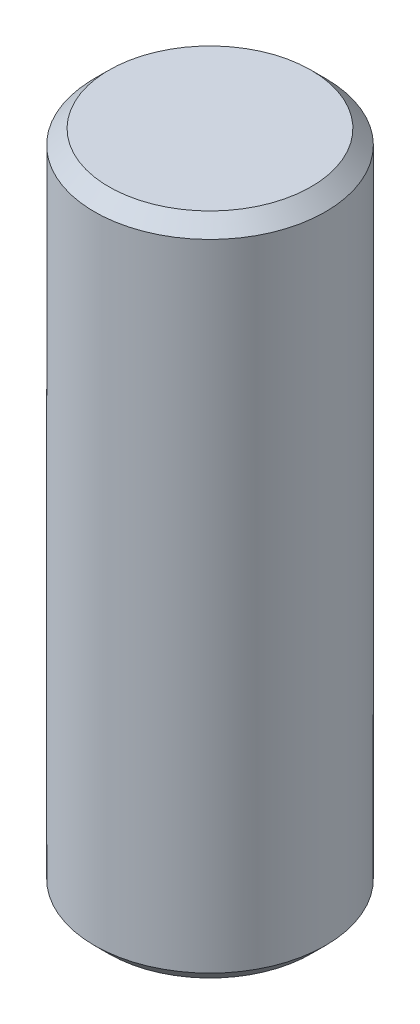
ISO-10303-21;
HEADER;
FILE_DESCRIPTION(('STEP AP214'),'2;1');
FILE_NAME('part.step','',(''),(''),'','','');
FILE_SCHEMA(('AUTOMOTIVE_DESIGN { 1 0 10303 214 1 1 1 1 }'));
ENDSEC;
DATA;
#1=APPLICATION_CONTEXT('core data for automotive mechanical design processes');
#2=APPLICATION_PROTOCOL_DEFINITION('international standard','automotive_design',2000,#1);
#3=PRODUCT_CONTEXT('',#1,'mechanical');
#4=PRODUCT('Part','Part','',(#3));
#5=PRODUCT_RELATED_PRODUCT_CATEGORY('part','',(#4));
#6=PRODUCT_DEFINITION_FORMATION('','',#4);
#7=PRODUCT_DEFINITION_CONTEXT('part definition',#1,'design');
#8=PRODUCT_DEFINITION('design','',#6,#7);
#9=PRODUCT_DEFINITION_SHAPE('','',#8);
#10=(LENGTH_UNIT() NAMED_UNIT(*) SI_UNIT(.MILLI.,.METRE.));
#11=(NAMED_UNIT(*) PLANE_ANGLE_UNIT() SI_UNIT($,.RADIAN.));
#12=(NAMED_UNIT(*) SI_UNIT($,.STERADIAN.) SOLID_ANGLE_UNIT());
#13=UNCERTAINTY_MEASURE_WITH_UNIT(LENGTH_MEASURE(1.E-05),#10,'distance_accuracy_value','');
#14=(GEOMETRIC_REPRESENTATION_CONTEXT(3) GLOBAL_UNCERTAINTY_ASSIGNED_CONTEXT((#13)) GLOBAL_UNIT_ASSIGNED_CONTEXT((#10,
#11,#12)) REPRESENTATION_CONTEXT('',''));
#15=CARTESIAN_POINT('',(0.,0.,0.));
#16=DIRECTION('',(0.,0.,1.));
#17=DIRECTION('',(1.,0.,0.));
#18=AXIS2_PLACEMENT_3D('',#15,#16,#17);
#19=CARTESIAN_POINT('',(0.,23.,0.));
#20=DIRECTION('',(0.,1.,0.));
#21=DIRECTION('',(-1.,0.,0.));
#22=AXIS2_PLACEMENT_3D('',#19,#20,#21);
#23=PLANE('',#22);
#24=CARTESIAN_POINT('',(0.,22.9999999999677,0.));
#25=DIRECTION('',(0.,-1.,0.));
#26=DIRECTION('',(0.,0.,-1.));
#27=AXIS2_PLACEMENT_3D('',#24,#25,#26);
#28=CIRCLE('',#27,3.50000000003092);
#29=CARTESIAN_POINT('',(0.,22.9999999999677,-3.50000000003092));
#30=VERTEX_POINT('',#29);
#31=EDGE_CURVE('E17',#30,#30,#28,.T.);
#32=ORIENTED_EDGE('',*,*,#31,.F.);
#33=EDGE_LOOP('',(#32));
#34=FACE_BOUND('',#33,.T.);
#35=ADVANCED_FACE('F14',(#34),#23,.T.);
#36=CARTESIAN_POINT('',(0.,0.,0.));
#37=DIRECTION('',(0.,1.,0.));
#38=DIRECTION('',(-1.,0.,0.));
#39=AXIS2_PLACEMENT_3D('',#36,#37,#38);
#40=PLANE('',#39);
#41=CARTESIAN_POINT('',(0.,0.,0.));
#42=DIRECTION('',(0.,1.,0.));
#43=DIRECTION('',(0.,0.,1.));
#44=AXIS2_PLACEMENT_3D('',#41,#42,#43);
#45=CIRCLE('',#44,3.49999999997408);
#46=CARTESIAN_POINT('',(0.,0.,3.49999999997408));
#47=VERTEX_POINT('',#46);
#48=EDGE_CURVE('E30',#47,#47,#45,.T.);
#49=ORIENTED_EDGE('',*,*,#48,.F.);
#50=EDGE_LOOP('',(#49));
#51=FACE_BOUND('',#50,.T.);
#52=ADVANCED_FACE('F45',(#51),#40,.F.);
#53=CARTESIAN_POINT('',(0.,22.5000000000932,0.));
#54=DIRECTION('',(0.,-1.,0.));
#55=DIRECTION('',(0.,0.,-1.));
#56=AXIS2_PLACEMENT_3D('',#53,#54,#55);
#57=CONICAL_SURFACE('',#56,3.99999999990541,0.785398163397448);
#58=CARTESIAN_POINT('',(0.,22.5,0.));
#59=DIRECTION('',(0.,-1.,0.));
#60=DIRECTION('',(1.,0.,0.));
#61=AXIS2_PLACEMENT_3D('',#58,#59,#60);
#62=CIRCLE('',#61,4.);
#63=CARTESIAN_POINT('',(4.,22.5,0.));
#64=VERTEX_POINT('',#63);
#65=EDGE_CURVE('E22',#64,#64,#62,.T.);
#66=ORIENTED_EDGE('',*,*,#65,.F.);
#67=EDGE_LOOP('',(#66));
#68=FACE_BOUND('',#67,.T.);
#69=ORIENTED_EDGE('',*,*,#31,.T.);
#70=EDGE_LOOP('',(#69));
#71=FACE_BOUND('',#70,.T.);
#72=ADVANCED_FACE('F42',(#68,#71),#57,.T.);
#73=CARTESIAN_POINT('',(0.,0.500000000101863,0.));
#74=DIRECTION('',(0.,1.,0.));
#75=DIRECTION('',(0.,0.,1.));
#76=AXIS2_PLACEMENT_3D('',#73,#74,#75);
#77=CONICAL_SURFACE('',#76,4.0000000000191,0.785398163340605);
#78=CARTESIAN_POINT('',(0.,0.5,0.));
#79=DIRECTION('',(0.,-1.,0.));
#80=DIRECTION('',(1.,0.,0.));
#81=AXIS2_PLACEMENT_3D('',#78,#79,#80);
#82=CIRCLE('',#81,4.);
#83=CARTESIAN_POINT('',(4.,0.5,0.));
#84=VERTEX_POINT('',#83);
#85=EDGE_CURVE('E10',#84,#84,#82,.F.);
#86=ORIENTED_EDGE('',*,*,#85,.F.);
#87=EDGE_LOOP('',(#86));
#88=FACE_BOUND('',#87,.T.);
#89=ORIENTED_EDGE('',*,*,#48,.T.);
#90=EDGE_LOOP('',(#89));
#91=FACE_BOUND('',#90,.T.);
#92=ADVANCED_FACE('F53',(#88,#91),#77,.T.);
#93=CARTESIAN_POINT('',(0.,23.,0.));
#94=DIRECTION('',(0.,-1.,0.));
#95=DIRECTION('',(1.,0.,0.));
#96=AXIS2_PLACEMENT_3D('',#93,#94,#95);
#97=CYLINDRICAL_SURFACE('',#96,4.);
#98=ORIENTED_EDGE('',*,*,#85,.T.);
#99=EDGE_LOOP('',(#98));
#100=FACE_BOUND('',#99,.T.);
#101=ORIENTED_EDGE('',*,*,#65,.T.);
#102=EDGE_LOOP('',(#101));
#103=FACE_BOUND('',#102,.T.);
#104=ADVANCED_FACE('F51',(#100,#103),#97,.T.);
#105=CLOSED_SHELL('',(#35,#52,#72,#92,#104));
#106=MANIFOLD_SOLID_BREP('B1',#105);
#107=ADVANCED_BREP_SHAPE_REPRESENTATION('',(#18,#106),#14);
#108=SHAPE_DEFINITION_REPRESENTATION(#9,#107);
ENDSEC;
END-ISO-10303-21;
